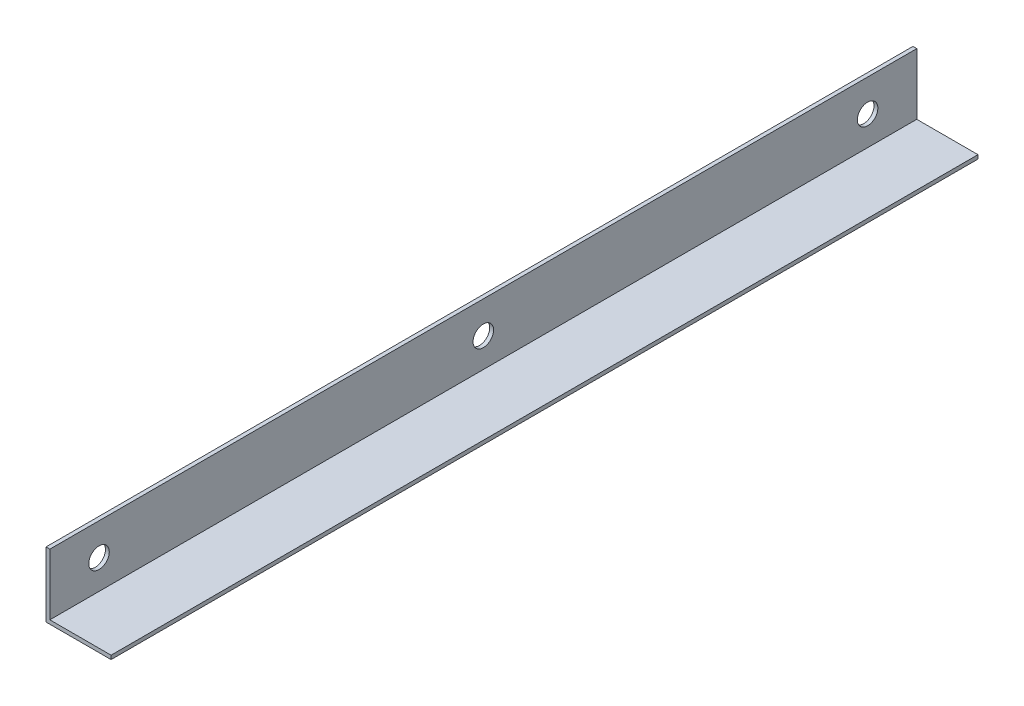
ISO-10303-21;
HEADER;
FILE_DESCRIPTION(('STEP AP214'),'2;1');
FILE_NAME('part.step','',(''),(''),'','','');
FILE_SCHEMA(('AUTOMOTIVE_DESIGN { 1 0 10303 214 1 1 1 1 }'));
ENDSEC;
DATA;
#1=APPLICATION_CONTEXT('core data for automotive mechanical design processes');
#2=APPLICATION_PROTOCOL_DEFINITION('international standard','automotive_design',2000,#1);
#3=PRODUCT_CONTEXT('',#1,'mechanical');
#4=PRODUCT('Part','Part','',(#3));
#5=PRODUCT_RELATED_PRODUCT_CATEGORY('part','',(#4));
#6=PRODUCT_DEFINITION_FORMATION('','',#4);
#7=PRODUCT_DEFINITION_CONTEXT('part definition',#1,'design');
#8=PRODUCT_DEFINITION('design','',#6,#7);
#9=PRODUCT_DEFINITION_SHAPE('','',#8);
#10=(LENGTH_UNIT() NAMED_UNIT(*) SI_UNIT(.MILLI.,.METRE.));
#11=(NAMED_UNIT(*) PLANE_ANGLE_UNIT() SI_UNIT($,.RADIAN.));
#12=(NAMED_UNIT(*) SI_UNIT($,.STERADIAN.) SOLID_ANGLE_UNIT());
#13=UNCERTAINTY_MEASURE_WITH_UNIT(LENGTH_MEASURE(1.E-05),#10,'distance_accuracy_value','');
#14=(GEOMETRIC_REPRESENTATION_CONTEXT(3) GLOBAL_UNCERTAINTY_ASSIGNED_CONTEXT((#13)) GLOBAL_UNIT_ASSIGNED_CONTEXT((#10,
#11,#12)) REPRESENTATION_CONTEXT('',''));
#15=CARTESIAN_POINT('',(0.,0.,0.));
#16=DIRECTION('',(0.,0.,1.));
#17=DIRECTION('',(1.,0.,0.));
#18=AXIS2_PLACEMENT_3D('',#15,#16,#17);
#19=CARTESIAN_POINT('',(0.,0.,338.4));
#20=DIRECTION('',(0.,1.,0.));
#21=DIRECTION('',(0.,0.,1.));
#22=AXIS2_PLACEMENT_3D('',#19,#20,#21);
#23=PLANE('',#22);
#24=DIRECTION('',(1.,0.,0.));
#25=VECTOR('',#24,1.);
#26=CARTESIAN_POINT('',(0.,0.,0.));
#27=LINE('',#26,#25);
#28=CARTESIAN_POINT('',(0.,0.,0.));
#29=VERTEX_POINT('',#28);
#30=CARTESIAN_POINT('',(25.4,0.,1.11022302462516E-13));
#31=VERTEX_POINT('',#30);
#32=EDGE_CURVE('E122',#29,#31,#27,.T.);
#33=ORIENTED_EDGE('',*,*,#32,.T.);
#34=DIRECTION('',(0.,0.,-1.));
#35=VECTOR('',#34,1.);
#36=CARTESIAN_POINT('',(25.4,0.,338.4));
#37=LINE('',#36,#35);
#38=CARTESIAN_POINT('',(25.4,0.,338.4));
#39=VERTEX_POINT('',#38);
#40=EDGE_CURVE('E11',#39,#31,#37,.T.);
#41=ORIENTED_EDGE('',*,*,#40,.F.);
#42=DIRECTION('',(1.,0.,0.));
#43=VECTOR('',#42,1.);
#44=CARTESIAN_POINT('',(0.,0.,338.4));
#45=LINE('',#44,#43);
#46=CARTESIAN_POINT('',(0.,0.,338.4));
#47=VERTEX_POINT('',#46);
#48=EDGE_CURVE('E133',#47,#39,#45,.T.);
#49=ORIENTED_EDGE('',*,*,#48,.F.);
#50=DIRECTION('',(0.,0.,-1.));
#51=VECTOR('',#50,1.);
#52=CARTESIAN_POINT('',(0.,0.,338.4));
#53=LINE('',#52,#51);
#54=EDGE_CURVE('E118',#47,#29,#53,.T.);
#55=ORIENTED_EDGE('',*,*,#54,.T.);
#56=EDGE_LOOP('',(#33,#41,#49,#55));
#57=FACE_BOUND('',#56,.T.);
#58=ADVANCED_FACE('F36',(#57),#23,.F.);
#59=CARTESIAN_POINT('',(25.4,1.5,338.4));
#60=DIRECTION('',(-1.,0.,0.));
#61=DIRECTION('',(0.,0.,1.));
#62=AXIS2_PLACEMENT_3D('',#59,#60,#61);
#63=PLANE('',#62);
#64=DIRECTION('',(0.,1.,0.));
#65=VECTOR('',#64,1.);
#66=CARTESIAN_POINT('',(25.4,1.49999999999999,1.11022302462516E-13));
#67=LINE('',#66,#65);
#68=CARTESIAN_POINT('',(25.4,1.49999999999999,1.11022302462516E-13));
#69=VERTEX_POINT('',#68);
#70=EDGE_CURVE('E125',#31,#69,#67,.T.);
#71=ORIENTED_EDGE('',*,*,#70,.T.);
#72=DIRECTION('',(0.,0.,-1.));
#73=VECTOR('',#72,1.);
#74=CARTESIAN_POINT('',(25.4,1.5,338.4));
#75=LINE('',#74,#73);
#76=CARTESIAN_POINT('',(25.4,1.5,338.4));
#77=VERTEX_POINT('',#76);
#78=EDGE_CURVE('E45',#77,#69,#75,.T.);
#79=ORIENTED_EDGE('',*,*,#78,.F.);
#80=DIRECTION('',(0.,1.,0.));
#81=VECTOR('',#80,1.);
#82=CARTESIAN_POINT('',(25.4,1.5,338.4));
#83=LINE('',#82,#81);
#84=EDGE_CURVE('E91',#39,#77,#83,.T.);
#85=ORIENTED_EDGE('',*,*,#84,.F.);
#86=ORIENTED_EDGE('',*,*,#40,.T.);
#87=EDGE_LOOP('',(#71,#79,#85,#86));
#88=FACE_BOUND('',#87,.T.);
#89=ADVANCED_FACE('F159',(#88),#63,.F.);
#90=CARTESIAN_POINT('',(1.5,1.5,338.4));
#91=DIRECTION('',(0.,-1.,0.));
#92=DIRECTION('',(0.,0.,-1.));
#93=AXIS2_PLACEMENT_3D('',#90,#91,#92);
#94=PLANE('',#93);
#95=DIRECTION('',(-1.,0.,0.));
#96=VECTOR('',#95,1.);
#97=CARTESIAN_POINT('',(1.5,1.5,0.));
#98=LINE('',#97,#96);
#99=CARTESIAN_POINT('',(1.5,1.5,0.));
#100=VERTEX_POINT('',#99);
#101=EDGE_CURVE('E128',#69,#100,#98,.T.);
#102=ORIENTED_EDGE('',*,*,#101,.T.);
#103=DIRECTION('',(0.,0.,-1.));
#104=VECTOR('',#103,1.);
#105=CARTESIAN_POINT('',(1.5,1.5,338.4));
#106=LINE('',#105,#104);
#107=CARTESIAN_POINT('',(1.5,1.5,338.4));
#108=VERTEX_POINT('',#107);
#109=EDGE_CURVE('E113',#108,#100,#106,.T.);
#110=ORIENTED_EDGE('',*,*,#109,.F.);
#111=DIRECTION('',(-1.,0.,0.));
#112=VECTOR('',#111,1.);
#113=CARTESIAN_POINT('',(1.5,1.5,338.4));
#114=LINE('',#113,#112);
#115=EDGE_CURVE('E104',#77,#108,#114,.T.);
#116=ORIENTED_EDGE('',*,*,#115,.F.);
#117=ORIENTED_EDGE('',*,*,#78,.T.);
#118=EDGE_LOOP('',(#102,#110,#116,#117));
#119=FACE_BOUND('',#118,.T.);
#120=ADVANCED_FACE('F162',(#119),#94,.F.);
#121=CARTESIAN_POINT('',(1.5,1.5,338.4));
#122=DIRECTION('',(-1.,0.,0.));
#123=DIRECTION('',(0.,0.,1.));
#124=AXIS2_PLACEMENT_3D('',#121,#122,#123);
#125=PLANE('',#124);
#126=CARTESIAN_POINT('',(1.5,12.9,169.2));
#127=DIRECTION('',(1.,0.,0.));
#128=DIRECTION('',(0.,0.,-1.));
#129=AXIS2_PLACEMENT_3D('',#126,#127,#128);
#130=CIRCLE('',#129,3.99999999999999);
#131=CARTESIAN_POINT('',(1.5,12.9,165.2));
#132=VERTEX_POINT('',#131);
#133=EDGE_CURVE('E153',#132,#132,#130,.T.);
#134=ORIENTED_EDGE('',*,*,#133,.F.);
#135=EDGE_LOOP('',(#134));
#136=FACE_BOUND('',#135,.T.);
#137=CARTESIAN_POINT('',(1.49999999999989,12.9,319.2));
#138=DIRECTION('',(1.,0.,0.));
#139=DIRECTION('',(0.,0.,-1.));
#140=AXIS2_PLACEMENT_3D('',#137,#138,#139);
#141=CIRCLE('',#140,3.99999999999999);
#142=CARTESIAN_POINT('',(1.49999999999989,12.9,315.2));
#143=VERTEX_POINT('',#142);
#144=EDGE_CURVE('E143',#143,#143,#141,.T.);
#145=ORIENTED_EDGE('',*,*,#144,.F.);
#146=EDGE_LOOP('',(#145));
#147=FACE_BOUND('',#146,.T.);
#148=CARTESIAN_POINT('',(1.49999999999989,12.9,19.2000000000001));
#149=DIRECTION('',(1.,0.,0.));
#150=DIRECTION('',(0.,0.,-1.));
#151=AXIS2_PLACEMENT_3D('',#148,#149,#150);
#152=CIRCLE('',#151,4.);
#153=CARTESIAN_POINT('',(1.49999999999989,12.9,15.2000000000001));
#154=VERTEX_POINT('',#153);
#155=EDGE_CURVE('E140',#154,#154,#152,.T.);
#156=ORIENTED_EDGE('',*,*,#155,.F.);
#157=EDGE_LOOP('',(#156));
#158=FACE_BOUND('',#157,.T.);
#159=DIRECTION('',(0.,1.,0.));
#160=VECTOR('',#159,1.);
#161=CARTESIAN_POINT('',(1.5,1.5,0.));
#162=LINE('',#161,#160);
#163=CARTESIAN_POINT('',(1.5,25.4,0.));
#164=VERTEX_POINT('',#163);
#165=EDGE_CURVE('E112',#100,#164,#162,.T.);
#166=ORIENTED_EDGE('',*,*,#165,.T.);
#167=DIRECTION('',(0.,0.,-1.));
#168=VECTOR('',#167,1.);
#169=CARTESIAN_POINT('',(1.5,25.4,338.4));
#170=LINE('',#169,#168);
#171=CARTESIAN_POINT('',(1.5,25.4,338.4));
#172=VERTEX_POINT('',#171);
#173=EDGE_CURVE('E109',#172,#164,#170,.T.);
#174=ORIENTED_EDGE('',*,*,#173,.F.);
#175=DIRECTION('',(0.,1.,0.));
#176=VECTOR('',#175,1.);
#177=CARTESIAN_POINT('',(1.5,1.5,338.4));
#178=LINE('',#177,#176);
#179=EDGE_CURVE('E98',#108,#172,#178,.T.);
#180=ORIENTED_EDGE('',*,*,#179,.F.);
#181=ORIENTED_EDGE('',*,*,#109,.T.);
#182=EDGE_LOOP('',(#166,#174,#180,#181));
#183=FACE_BOUND('',#182,.T.);
#184=ADVANCED_FACE('F110',(#136,#147,#158,#183),#125,.F.);
#185=CARTESIAN_POINT('',(0.,25.4,338.4));
#186=DIRECTION('',(0.,-1.,0.));
#187=DIRECTION('',(0.,0.,-1.));
#188=AXIS2_PLACEMENT_3D('',#185,#186,#187);
#189=PLANE('',#188);
#190=DIRECTION('',(-1.,0.,0.));
#191=VECTOR('',#190,1.);
#192=CARTESIAN_POINT('',(0.,25.4,0.));
#193=LINE('',#192,#191);
#194=CARTESIAN_POINT('',(0.,25.4,0.));
#195=VERTEX_POINT('',#194);
#196=EDGE_CURVE('E77',#164,#195,#193,.T.);
#197=ORIENTED_EDGE('',*,*,#196,.T.);
#198=DIRECTION('',(0.,0.,-1.));
#199=VECTOR('',#198,1.);
#200=CARTESIAN_POINT('',(0.,25.4,338.4));
#201=LINE('',#200,#199);
#202=CARTESIAN_POINT('',(0.,25.4,338.4));
#203=VERTEX_POINT('',#202);
#204=EDGE_CURVE('E114',#203,#195,#201,.T.);
#205=ORIENTED_EDGE('',*,*,#204,.F.);
#206=DIRECTION('',(-1.,0.,0.));
#207=VECTOR('',#206,1.);
#208=CARTESIAN_POINT('',(0.,25.4,338.4));
#209=LINE('',#208,#207);
#210=EDGE_CURVE('E102',#172,#203,#209,.T.);
#211=ORIENTED_EDGE('',*,*,#210,.F.);
#212=ORIENTED_EDGE('',*,*,#173,.T.);
#213=EDGE_LOOP('',(#197,#205,#211,#212));
#214=FACE_BOUND('',#213,.T.);
#215=ADVANCED_FACE('F116',(#214),#189,.F.);
#216=CARTESIAN_POINT('',(0.,0.,338.4));
#217=DIRECTION('',(1.,0.,0.));
#218=DIRECTION('',(0.,0.,-1.));
#219=AXIS2_PLACEMENT_3D('',#216,#217,#218);
#220=PLANE('',#219);
#221=CARTESIAN_POINT('',(0.,12.9,169.2));
#222=DIRECTION('',(1.,0.,0.));
#223=DIRECTION('',(0.,0.,-1.));
#224=AXIS2_PLACEMENT_3D('',#221,#222,#223);
#225=CIRCLE('',#224,3.99999999999999);
#226=CARTESIAN_POINT('',(0.,12.9,165.2));
#227=VERTEX_POINT('',#226);
#228=EDGE_CURVE('E39',#227,#227,#225,.T.);
#229=ORIENTED_EDGE('',*,*,#228,.T.);
#230=EDGE_LOOP('',(#229));
#231=FACE_BOUND('',#230,.T.);
#232=CARTESIAN_POINT('',(-1.11022302462516E-13,12.9,319.2));
#233=DIRECTION('',(1.,0.,0.));
#234=DIRECTION('',(0.,0.,-1.));
#235=AXIS2_PLACEMENT_3D('',#232,#233,#234);
#236=CIRCLE('',#235,3.99999999999999);
#237=CARTESIAN_POINT('',(-1.11022302462516E-13,12.9,315.2));
#238=VERTEX_POINT('',#237);
#239=EDGE_CURVE('E141',#238,#238,#236,.T.);
#240=ORIENTED_EDGE('',*,*,#239,.T.);
#241=EDGE_LOOP('',(#240));
#242=FACE_BOUND('',#241,.T.);
#243=CARTESIAN_POINT('',(-1.11022302462516E-13,12.9,19.2000000000001));
#244=DIRECTION('',(1.,0.,0.));
#245=DIRECTION('',(0.,0.,-1.));
#246=AXIS2_PLACEMENT_3D('',#243,#244,#245);
#247=CIRCLE('',#246,4.);
#248=CARTESIAN_POINT('',(-1.11022302462516E-13,12.9,15.2000000000001));
#249=VERTEX_POINT('',#248);
#250=EDGE_CURVE('E126',#249,#249,#247,.T.);
#251=ORIENTED_EDGE('',*,*,#250,.T.);
#252=EDGE_LOOP('',(#251));
#253=FACE_BOUND('',#252,.T.);
#254=DIRECTION('',(0.,-1.,0.));
#255=VECTOR('',#254,1.);
#256=CARTESIAN_POINT('',(0.,0.,0.));
#257=LINE('',#256,#255);
#258=EDGE_CURVE('E83',#195,#29,#257,.T.);
#259=ORIENTED_EDGE('',*,*,#258,.T.);
#260=ORIENTED_EDGE('',*,*,#54,.F.);
#261=DIRECTION('',(0.,-1.,0.));
#262=VECTOR('',#261,1.);
#263=CARTESIAN_POINT('',(0.,0.,338.4));
#264=LINE('',#263,#262);
#265=EDGE_CURVE('E54',#203,#47,#264,.T.);
#266=ORIENTED_EDGE('',*,*,#265,.F.);
#267=ORIENTED_EDGE('',*,*,#204,.T.);
#268=EDGE_LOOP('',(#259,#260,#266,#267));
#269=FACE_BOUND('',#268,.T.);
#270=ADVANCED_FACE('F167',(#231,#242,#253,#269),#220,.F.);
#271=CARTESIAN_POINT('',(0.,0.,338.4));
#272=DIRECTION('',(0.,0.,-1.));
#273=DIRECTION('',(-1.,0.,0.));
#274=AXIS2_PLACEMENT_3D('',#271,#272,#273);
#275=PLANE('',#274);
#276=ORIENTED_EDGE('',*,*,#48,.T.);
#277=ORIENTED_EDGE('',*,*,#84,.T.);
#278=ORIENTED_EDGE('',*,*,#115,.T.);
#279=ORIENTED_EDGE('',*,*,#179,.T.);
#280=ORIENTED_EDGE('',*,*,#210,.T.);
#281=ORIENTED_EDGE('',*,*,#265,.T.);
#282=EDGE_LOOP('',(#276,#277,#278,#279,#280,#281));
#283=FACE_BOUND('',#282,.T.);
#284=ADVANCED_FACE('F100',(#283),#275,.F.);
#285=CARTESIAN_POINT('',(0.,0.,0.));
#286=DIRECTION('',(0.,0.,-1.));
#287=DIRECTION('',(-1.,0.,0.));
#288=AXIS2_PLACEMENT_3D('',#285,#286,#287);
#289=PLANE('',#288);
#290=ORIENTED_EDGE('',*,*,#32,.F.);
#291=ORIENTED_EDGE('',*,*,#258,.F.);
#292=ORIENTED_EDGE('',*,*,#196,.F.);
#293=ORIENTED_EDGE('',*,*,#165,.F.);
#294=ORIENTED_EDGE('',*,*,#101,.F.);
#295=ORIENTED_EDGE('',*,*,#70,.F.);
#296=EDGE_LOOP('',(#290,#291,#292,#293,#294,#295));
#297=FACE_BOUND('',#296,.T.);
#298=ADVANCED_FACE('F165',(#297),#289,.T.);
#299=CARTESIAN_POINT('',(-0.500000000000111,12.9,19.2000000000001));
#300=DIRECTION('',(1.,0.,0.));
#301=DIRECTION('',(0.,0.,-1.));
#302=AXIS2_PLACEMENT_3D('',#299,#300,#301);
#303=CYLINDRICAL_SURFACE('',#302,4.);
#304=ORIENTED_EDGE('',*,*,#155,.T.);
#305=EDGE_LOOP('',(#304));
#306=FACE_BOUND('',#305,.T.);
#307=ORIENTED_EDGE('',*,*,#250,.F.);
#308=EDGE_LOOP('',(#307));
#309=FACE_BOUND('',#308,.T.);
#310=ADVANCED_FACE('F197',(#306,#309),#303,.F.);
#311=CARTESIAN_POINT('',(-0.500000000000111,12.9,319.2));
#312=DIRECTION('',(1.,0.,0.));
#313=DIRECTION('',(0.,0.,-1.));
#314=AXIS2_PLACEMENT_3D('',#311,#312,#313);
#315=CYLINDRICAL_SURFACE('',#314,3.99999999999999);
#316=ORIENTED_EDGE('',*,*,#144,.T.);
#317=EDGE_LOOP('',(#316));
#318=FACE_BOUND('',#317,.T.);
#319=ORIENTED_EDGE('',*,*,#239,.F.);
#320=EDGE_LOOP('',(#319));
#321=FACE_BOUND('',#320,.T.);
#322=ADVANCED_FACE('F200',(#318,#321),#315,.F.);
#323=CARTESIAN_POINT('',(-0.5,12.9,169.2));
#324=DIRECTION('',(1.,0.,0.));
#325=DIRECTION('',(0.,0.,-1.));
#326=AXIS2_PLACEMENT_3D('',#323,#324,#325);
#327=CYLINDRICAL_SURFACE('',#326,3.99999999999999);
#328=ORIENTED_EDGE('',*,*,#133,.T.);
#329=EDGE_LOOP('',(#328));
#330=FACE_BOUND('',#329,.T.);
#331=ORIENTED_EDGE('',*,*,#228,.F.);
#332=EDGE_LOOP('',(#331));
#333=FACE_BOUND('',#332,.T.);
#334=ADVANCED_FACE('F208',(#330,#333),#327,.F.);
#335=CLOSED_SHELL('',(#58,#89,#120,#184,#215,#270,#284,#298,#310,#322,#334));
#336=MANIFOLD_SOLID_BREP('B2',#335);
#337=ADVANCED_BREP_SHAPE_REPRESENTATION('',(#18,#336),#14);
#338=SHAPE_DEFINITION_REPRESENTATION(#9,#337);
ENDSEC;
END-ISO-10303-21;
